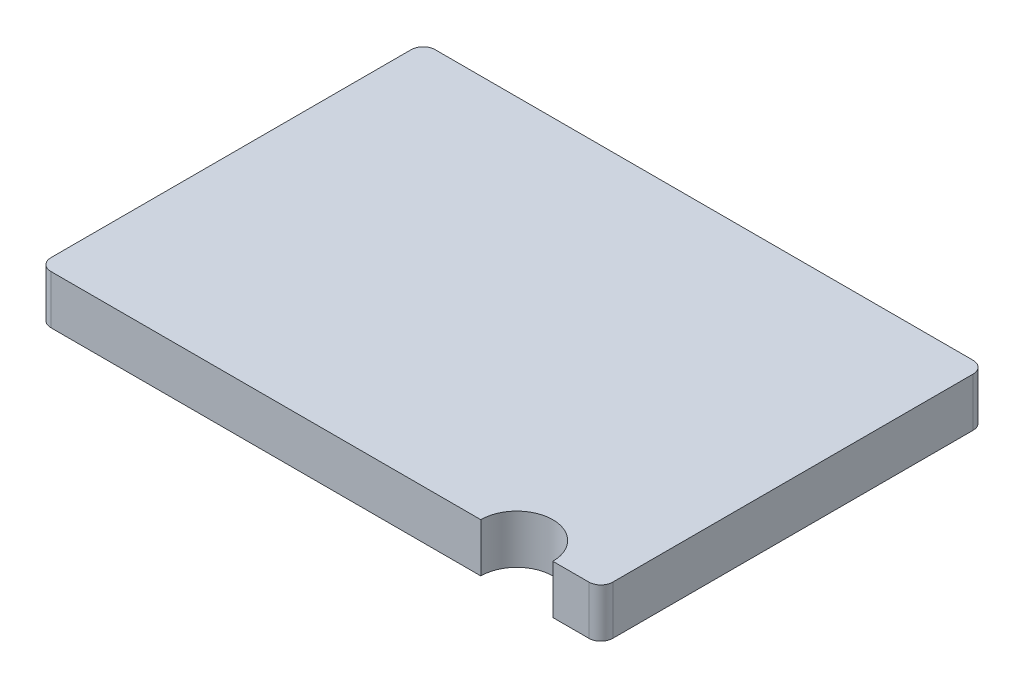
ISO-10303-21;
HEADER;
FILE_DESCRIPTION(('STEP AP214'),'2;1');
FILE_NAME('part.step','',(''),(''),'','','');
FILE_SCHEMA(('AUTOMOTIVE_DESIGN { 1 0 10303 214 1 1 1 1 }'));
ENDSEC;
DATA;
#1=APPLICATION_CONTEXT('core data for automotive mechanical design processes');
#2=APPLICATION_PROTOCOL_DEFINITION('international standard','automotive_design',2000,#1);
#3=PRODUCT_CONTEXT('',#1,'mechanical');
#4=PRODUCT('Part','Part','',(#3));
#5=PRODUCT_RELATED_PRODUCT_CATEGORY('part','',(#4));
#6=PRODUCT_DEFINITION_FORMATION('','',#4);
#7=PRODUCT_DEFINITION_CONTEXT('part definition',#1,'design');
#8=PRODUCT_DEFINITION('design','',#6,#7);
#9=PRODUCT_DEFINITION_SHAPE('','',#8);
#10=(LENGTH_UNIT() NAMED_UNIT(*) SI_UNIT(.MILLI.,.METRE.));
#11=(NAMED_UNIT(*) PLANE_ANGLE_UNIT() SI_UNIT($,.RADIAN.));
#12=(NAMED_UNIT(*) SI_UNIT($,.STERADIAN.) SOLID_ANGLE_UNIT());
#13=UNCERTAINTY_MEASURE_WITH_UNIT(LENGTH_MEASURE(1.E-05),#10,'distance_accuracy_value','');
#14=(GEOMETRIC_REPRESENTATION_CONTEXT(3) GLOBAL_UNCERTAINTY_ASSIGNED_CONTEXT((#13)) GLOBAL_UNIT_ASSIGNED_CONTEXT((#10,
#11,#12)) REPRESENTATION_CONTEXT('',''));
#15=CARTESIAN_POINT('',(0.,0.,0.));
#16=DIRECTION('',(0.,0.,1.));
#17=DIRECTION('',(1.,0.,0.));
#18=AXIS2_PLACEMENT_3D('',#15,#16,#17);
#19=CARTESIAN_POINT('',(-1.17,0.203,0.8));
#20=DIRECTION('',(0.,0.,-1.));
#21=DIRECTION('',(-1.,0.,0.));
#22=AXIS2_PLACEMENT_3D('',#19,#20,#21);
#23=PLANE('',#22);
#24=DIRECTION('',(1.,0.,0.));
#25=VECTOR('',#24,1.);
#26=CARTESIAN_POINT('',(-1.17,0.,0.8));
#27=LINE('',#26,#25);
#28=CARTESIAN_POINT('',(-1.12,0.,0.8));
#29=VERTEX_POINT('',#28);
#30=CARTESIAN_POINT('',(0.670000000000001,0.,0.8));
#31=VERTEX_POINT('',#30);
#32=EDGE_CURVE('E128',#29,#31,#27,.T.);
#33=ORIENTED_EDGE('',*,*,#32,.T.);
#34=DIRECTION('',(0.,1.,0.));
#35=VECTOR('',#34,1.);
#36=CARTESIAN_POINT('',(0.670000000000001,0.,0.8));
#37=LINE('',#36,#35);
#38=CARTESIAN_POINT('',(0.670000000000001,0.203,0.8));
#39=VERTEX_POINT('',#38);
#40=EDGE_CURVE('E50',#31,#39,#37,.T.);
#41=ORIENTED_EDGE('',*,*,#40,.T.);
#42=DIRECTION('',(1.,0.,0.));
#43=VECTOR('',#42,1.);
#44=CARTESIAN_POINT('',(-1.17,0.203,0.8));
#45=LINE('',#44,#43);
#46=CARTESIAN_POINT('',(-1.12,0.203,0.8));
#47=VERTEX_POINT('',#46);
#48=EDGE_CURVE('E140',#47,#39,#45,.T.);
#49=ORIENTED_EDGE('',*,*,#48,.F.);
#50=DIRECTION('',(0.,-1.,0.));
#51=VECTOR('',#50,1.);
#52=CARTESIAN_POINT('',(-1.12,0.203,0.8));
#53=LINE('',#52,#51);
#54=EDGE_CURVE('E43',#47,#29,#53,.T.);
#55=ORIENTED_EDGE('',*,*,#54,.T.);
#56=EDGE_LOOP('',(#33,#41,#49,#55));
#57=FACE_BOUND('',#56,.T.);
#58=ADVANCED_FACE('F35',(#57),#23,.F.);
#59=CARTESIAN_POINT('',(1.17,0.203,-0.8));
#60=DIRECTION('',(-1.,0.,0.));
#61=DIRECTION('',(0.,0.,1.));
#62=AXIS2_PLACEMENT_3D('',#59,#60,#61);
#63=PLANE('',#62);
#64=DIRECTION('',(0.,0.,-1.));
#65=VECTOR('',#64,1.);
#66=CARTESIAN_POINT('',(1.17,0.,-0.8));
#67=LINE('',#66,#65);
#68=CARTESIAN_POINT('',(1.17,0.,0.75));
#69=VERTEX_POINT('',#68);
#70=CARTESIAN_POINT('',(1.17,0.,-0.75));
#71=VERTEX_POINT('',#70);
#72=EDGE_CURVE('E191',#69,#71,#67,.T.);
#73=ORIENTED_EDGE('',*,*,#72,.T.);
#74=DIRECTION('',(0.,-1.,0.));
#75=VECTOR('',#74,1.);
#76=CARTESIAN_POINT('',(1.17,0.203,-0.75));
#77=LINE('',#76,#75);
#78=CARTESIAN_POINT('',(1.17,0.203,-0.75));
#79=VERTEX_POINT('',#78);
#80=EDGE_CURVE('E166',#71,#79,#77,.F.);
#81=ORIENTED_EDGE('',*,*,#80,.T.);
#82=DIRECTION('',(0.,0.,-1.));
#83=VECTOR('',#82,1.);
#84=CARTESIAN_POINT('',(1.17,0.203,-0.8));
#85=LINE('',#84,#83);
#86=CARTESIAN_POINT('',(1.17,0.203,0.75));
#87=VERTEX_POINT('',#86);
#88=EDGE_CURVE('E131',#87,#79,#85,.T.);
#89=ORIENTED_EDGE('',*,*,#88,.F.);
#90=DIRECTION('',(0.,-1.,0.));
#91=VECTOR('',#90,1.);
#92=CARTESIAN_POINT('',(1.17,0.203,0.75));
#93=LINE('',#92,#91);
#94=EDGE_CURVE('E163',#87,#69,#93,.T.);
#95=ORIENTED_EDGE('',*,*,#94,.T.);
#96=EDGE_LOOP('',(#73,#81,#89,#95));
#97=FACE_BOUND('',#96,.T.);
#98=ADVANCED_FACE('F215',(#97),#63,.F.);
#99=CARTESIAN_POINT('',(-1.17,0.203,-0.8));
#100=DIRECTION('',(0.,0.,1.));
#101=DIRECTION('',(1.,0.,0.));
#102=AXIS2_PLACEMENT_3D('',#99,#100,#101);
#103=PLANE('',#102);
#104=DIRECTION('',(-1.,0.,0.));
#105=VECTOR('',#104,1.);
#106=CARTESIAN_POINT('',(-1.17,0.,-0.8));
#107=LINE('',#106,#105);
#108=CARTESIAN_POINT('',(1.12,0.,-0.8));
#109=VERTEX_POINT('',#108);
#110=CARTESIAN_POINT('',(-1.12,0.,-0.8));
#111=VERTEX_POINT('',#110);
#112=EDGE_CURVE('E133',#109,#111,#107,.T.);
#113=ORIENTED_EDGE('',*,*,#112,.T.);
#114=DIRECTION('',(0.,-1.,0.));
#115=VECTOR('',#114,1.);
#116=CARTESIAN_POINT('',(-1.12,0.203,-0.8));
#117=LINE('',#116,#115);
#118=CARTESIAN_POINT('',(-1.12,0.203,-0.8));
#119=VERTEX_POINT('',#118);
#120=EDGE_CURVE('E153',#111,#119,#117,.F.);
#121=ORIENTED_EDGE('',*,*,#120,.T.);
#122=DIRECTION('',(-1.,0.,0.));
#123=VECTOR('',#122,1.);
#124=CARTESIAN_POINT('',(-1.17,0.203,-0.8));
#125=LINE('',#124,#123);
#126=CARTESIAN_POINT('',(1.12,0.203,-0.8));
#127=VERTEX_POINT('',#126);
#128=EDGE_CURVE('E185',#127,#119,#125,.T.);
#129=ORIENTED_EDGE('',*,*,#128,.F.);
#130=DIRECTION('',(0.,-1.,0.));
#131=VECTOR('',#130,1.);
#132=CARTESIAN_POINT('',(1.12,0.203,-0.8));
#133=LINE('',#132,#131);
#134=EDGE_CURVE('E150',#127,#109,#133,.T.);
#135=ORIENTED_EDGE('',*,*,#134,.T.);
#136=EDGE_LOOP('',(#113,#121,#129,#135));
#137=FACE_BOUND('',#136,.T.);
#138=ADVANCED_FACE('F197',(#137),#103,.F.);
#139=CARTESIAN_POINT('',(-1.17,0.203,-0.8));
#140=DIRECTION('',(1.,0.,0.));
#141=DIRECTION('',(0.,0.,-1.));
#142=AXIS2_PLACEMENT_3D('',#139,#140,#141);
#143=PLANE('',#142);
#144=DIRECTION('',(0.,0.,1.));
#145=VECTOR('',#144,1.);
#146=CARTESIAN_POINT('',(-1.17,0.203,-0.8));
#147=LINE('',#146,#145);
#148=CARTESIAN_POINT('',(-1.17,0.203,-0.75));
#149=VERTEX_POINT('',#148);
#150=CARTESIAN_POINT('',(-1.17,0.203,0.75));
#151=VERTEX_POINT('',#150);
#152=EDGE_CURVE('E182',#149,#151,#147,.T.);
#153=ORIENTED_EDGE('',*,*,#152,.F.);
#154=DIRECTION('',(0.,-1.,0.));
#155=VECTOR('',#154,1.);
#156=CARTESIAN_POINT('',(-1.17,0.203,-0.75));
#157=LINE('',#156,#155);
#158=CARTESIAN_POINT('',(-1.17,0.,-0.75));
#159=VERTEX_POINT('',#158);
#160=EDGE_CURVE('E139',#149,#159,#157,.T.);
#161=ORIENTED_EDGE('',*,*,#160,.T.);
#162=DIRECTION('',(0.,0.,1.));
#163=VECTOR('',#162,1.);
#164=CARTESIAN_POINT('',(-1.17,0.,-0.8));
#165=LINE('',#164,#163);
#166=CARTESIAN_POINT('',(-1.17,0.,0.75));
#167=VERTEX_POINT('',#166);
#168=EDGE_CURVE('E129',#159,#167,#165,.T.);
#169=ORIENTED_EDGE('',*,*,#168,.T.);
#170=DIRECTION('',(0.,-1.,0.));
#171=VECTOR('',#170,1.);
#172=CARTESIAN_POINT('',(-1.17,0.203,0.75));
#173=LINE('',#172,#171);
#174=EDGE_CURVE('E137',#167,#151,#173,.F.);
#175=ORIENTED_EDGE('',*,*,#174,.T.);
#176=EDGE_LOOP('',(#153,#161,#169,#175));
#177=FACE_BOUND('',#176,.T.);
#178=ADVANCED_FACE('F178',(#177),#143,.F.);
#179=CARTESIAN_POINT('',(0.970000000000001,0.203,0.8));
#180=VERTEX_POINT('',#179);
#181=CARTESIAN_POINT('',(1.12,0.203,0.8));
#182=VERTEX_POINT('',#181);
#183=EDGE_CURVE('E58',#180,#182,#45,.T.);
#184=ORIENTED_EDGE('',*,*,#183,.F.);
#185=DIRECTION('',(0.,1.,0.));
#186=VECTOR('',#185,1.);
#187=CARTESIAN_POINT('',(0.970000000000001,0.,0.8));
#188=LINE('',#187,#186);
#189=CARTESIAN_POINT('',(0.970000000000001,0.,0.8));
#190=VERTEX_POINT('',#189);
#191=EDGE_CURVE('E112',#180,#190,#188,.F.);
#192=ORIENTED_EDGE('',*,*,#191,.T.);
#193=CARTESIAN_POINT('',(1.12,0.,0.8));
#194=VERTEX_POINT('',#193);
#195=EDGE_CURVE('E121',#190,#194,#27,.T.);
#196=ORIENTED_EDGE('',*,*,#195,.T.);
#197=DIRECTION('',(0.,-1.,0.));
#198=VECTOR('',#197,1.);
#199=CARTESIAN_POINT('',(1.12,0.203,0.8));
#200=LINE('',#199,#198);
#201=EDGE_CURVE('E11',#194,#182,#200,.F.);
#202=ORIENTED_EDGE('',*,*,#201,.T.);
#203=EDGE_LOOP('',(#184,#192,#196,#202));
#204=FACE_BOUND('',#203,.T.);
#205=ADVANCED_FACE('F120',(#204),#23,.F.);
#206=CARTESIAN_POINT('',(0.,0.203,0.));
#207=DIRECTION('',(0.,1.,0.));
#208=DIRECTION('',(0.,0.,1.));
#209=AXIS2_PLACEMENT_3D('',#206,#207,#208);
#210=PLANE('',#209);
#211=CARTESIAN_POINT('',(0.820000000000001,0.203,0.8));
#212=DIRECTION('',(0.,1.,0.));
#213=DIRECTION('',(0.,0.,1.));
#214=AXIS2_PLACEMENT_3D('',#211,#212,#213);
#215=CIRCLE('',#214,0.15);
#216=EDGE_CURVE('E117',#180,#39,#215,.T.);
#217=ORIENTED_EDGE('',*,*,#216,.F.);
#218=ORIENTED_EDGE('',*,*,#183,.T.);
#219=CARTESIAN_POINT('',(1.12,0.203,0.75));
#220=DIRECTION('',(0.,1.,0.));
#221=DIRECTION('',(0.,0.,1.));
#222=AXIS2_PLACEMENT_3D('',#219,#220,#221);
#223=CIRCLE('',#222,0.05);
#224=EDGE_CURVE('E157',#182,#87,#223,.T.);
#225=ORIENTED_EDGE('',*,*,#224,.T.);
#226=ORIENTED_EDGE('',*,*,#88,.T.);
#227=CARTESIAN_POINT('',(1.12,0.203,-0.75));
#228=DIRECTION('',(0.,1.,0.));
#229=DIRECTION('',(0.,0.,1.));
#230=AXIS2_PLACEMENT_3D('',#227,#228,#229);
#231=CIRCLE('',#230,0.05);
#232=EDGE_CURVE('E159',#79,#127,#231,.T.);
#233=ORIENTED_EDGE('',*,*,#232,.T.);
#234=ORIENTED_EDGE('',*,*,#128,.T.);
#235=CARTESIAN_POINT('',(-1.12,0.203,-0.75));
#236=DIRECTION('',(0.,1.,0.));
#237=DIRECTION('',(0.,0.,1.));
#238=AXIS2_PLACEMENT_3D('',#235,#236,#237);
#239=CIRCLE('',#238,0.05);
#240=EDGE_CURVE('E161',#119,#149,#239,.T.);
#241=ORIENTED_EDGE('',*,*,#240,.T.);
#242=ORIENTED_EDGE('',*,*,#152,.T.);
#243=CARTESIAN_POINT('',(-1.12,0.203,0.75));
#244=DIRECTION('',(0.,1.,0.));
#245=DIRECTION('',(0.,0.,1.));
#246=AXIS2_PLACEMENT_3D('',#243,#244,#245);
#247=CIRCLE('',#246,0.05);
#248=EDGE_CURVE('E155',#151,#47,#247,.T.);
#249=ORIENTED_EDGE('',*,*,#248,.T.);
#250=ORIENTED_EDGE('',*,*,#48,.T.);
#251=EDGE_LOOP('',(#217,#218,#225,#226,#233,#234,#241,#242,#249,#250));
#252=FACE_BOUND('',#251,.T.);
#253=ADVANCED_FACE('F181',(#252),#210,.T.);
#254=CARTESIAN_POINT('',(0.,0.,0.));
#255=DIRECTION('',(0.,1.,0.));
#256=DIRECTION('',(0.,0.,1.));
#257=AXIS2_PLACEMENT_3D('',#254,#255,#256);
#258=PLANE('',#257);
#259=ORIENTED_EDGE('',*,*,#195,.F.);
#260=CARTESIAN_POINT('',(0.820000000000001,0.,0.8));
#261=DIRECTION('',(0.,1.,0.));
#262=DIRECTION('',(0.,0.,1.));
#263=AXIS2_PLACEMENT_3D('',#260,#261,#262);
#264=CIRCLE('',#263,0.15);
#265=EDGE_CURVE('E109',#190,#31,#264,.T.);
#266=ORIENTED_EDGE('',*,*,#265,.T.);
#267=ORIENTED_EDGE('',*,*,#32,.F.);
#268=CARTESIAN_POINT('',(-1.12,0.,0.75));
#269=DIRECTION('',(0.,1.,0.));
#270=DIRECTION('',(0.,0.,1.));
#271=AXIS2_PLACEMENT_3D('',#268,#269,#270);
#272=CIRCLE('',#271,0.05);
#273=EDGE_CURVE('E143',#29,#167,#272,.F.);
#274=ORIENTED_EDGE('',*,*,#273,.T.);
#275=ORIENTED_EDGE('',*,*,#168,.F.);
#276=CARTESIAN_POINT('',(-1.12,0.,-0.75));
#277=DIRECTION('',(0.,1.,0.));
#278=DIRECTION('',(0.,0.,1.));
#279=AXIS2_PLACEMENT_3D('',#276,#277,#278);
#280=CIRCLE('',#279,0.05);
#281=EDGE_CURVE('E148',#159,#111,#280,.F.);
#282=ORIENTED_EDGE('',*,*,#281,.T.);
#283=ORIENTED_EDGE('',*,*,#112,.F.);
#284=CARTESIAN_POINT('',(1.12,0.,-0.75));
#285=DIRECTION('',(0.,1.,0.));
#286=DIRECTION('',(0.,0.,1.));
#287=AXIS2_PLACEMENT_3D('',#284,#285,#286);
#288=CIRCLE('',#287,0.05);
#289=EDGE_CURVE('E146',#109,#71,#288,.F.);
#290=ORIENTED_EDGE('',*,*,#289,.T.);
#291=ORIENTED_EDGE('',*,*,#72,.F.);
#292=CARTESIAN_POINT('',(1.12,0.,0.75));
#293=DIRECTION('',(0.,1.,0.));
#294=DIRECTION('',(0.,0.,1.));
#295=AXIS2_PLACEMENT_3D('',#292,#293,#294);
#296=CIRCLE('',#295,0.05);
#297=EDGE_CURVE('E126',#69,#194,#296,.F.);
#298=ORIENTED_EDGE('',*,*,#297,.T.);
#299=EDGE_LOOP('',(#259,#266,#267,#274,#275,#282,#283,#290,#291,#298));
#300=FACE_BOUND('',#299,.T.);
#301=ADVANCED_FACE('F124',(#300),#258,.F.);
#302=CARTESIAN_POINT('',(-1.12,0.203,-0.75));
#303=DIRECTION('',(0.,-1.,0.));
#304=DIRECTION('',(0.,0.,-1.));
#305=AXIS2_PLACEMENT_3D('',#302,#303,#304);
#306=CYLINDRICAL_SURFACE('',#305,0.05);
#307=ORIENTED_EDGE('',*,*,#240,.F.);
#308=ORIENTED_EDGE('',*,*,#120,.F.);
#309=ORIENTED_EDGE('',*,*,#281,.F.);
#310=ORIENTED_EDGE('',*,*,#160,.F.);
#311=EDGE_LOOP('',(#307,#308,#309,#310));
#312=FACE_BOUND('',#311,.T.);
#313=ADVANCED_FACE('F201',(#312),#306,.T.);
#314=CARTESIAN_POINT('',(1.12,0.203,-0.75));
#315=DIRECTION('',(0.,-1.,0.));
#316=DIRECTION('',(0.,0.,-1.));
#317=AXIS2_PLACEMENT_3D('',#314,#315,#316);
#318=CYLINDRICAL_SURFACE('',#317,0.05);
#319=ORIENTED_EDGE('',*,*,#232,.F.);
#320=ORIENTED_EDGE('',*,*,#80,.F.);
#321=ORIENTED_EDGE('',*,*,#289,.F.);
#322=ORIENTED_EDGE('',*,*,#134,.F.);
#323=EDGE_LOOP('',(#319,#320,#321,#322));
#324=FACE_BOUND('',#323,.T.);
#325=ADVANCED_FACE('F203',(#324),#318,.T.);
#326=CARTESIAN_POINT('',(1.12,0.203,0.75));
#327=DIRECTION('',(0.,-1.,0.));
#328=DIRECTION('',(0.,0.,-1.));
#329=AXIS2_PLACEMENT_3D('',#326,#327,#328);
#330=CYLINDRICAL_SURFACE('',#329,0.05);
#331=ORIENTED_EDGE('',*,*,#224,.F.);
#332=ORIENTED_EDGE('',*,*,#201,.F.);
#333=ORIENTED_EDGE('',*,*,#297,.F.);
#334=ORIENTED_EDGE('',*,*,#94,.F.);
#335=EDGE_LOOP('',(#331,#332,#333,#334));
#336=FACE_BOUND('',#335,.T.);
#337=ADVANCED_FACE('F209',(#336),#330,.T.);
#338=CARTESIAN_POINT('',(-1.12,0.203,0.75));
#339=DIRECTION('',(0.,-1.,0.));
#340=DIRECTION('',(0.,0.,-1.));
#341=AXIS2_PLACEMENT_3D('',#338,#339,#340);
#342=CYLINDRICAL_SURFACE('',#341,0.05);
#343=ORIENTED_EDGE('',*,*,#248,.F.);
#344=ORIENTED_EDGE('',*,*,#174,.F.);
#345=ORIENTED_EDGE('',*,*,#273,.F.);
#346=ORIENTED_EDGE('',*,*,#54,.F.);
#347=EDGE_LOOP('',(#343,#344,#345,#346));
#348=FACE_BOUND('',#347,.T.);
#349=ADVANCED_FACE('F37',(#348),#342,.T.);
#350=CARTESIAN_POINT('',(0.820000000000001,0.,0.8));
#351=DIRECTION('',(0.,1.,0.));
#352=DIRECTION('',(0.,0.,1.));
#353=AXIS2_PLACEMENT_3D('',#350,#351,#352);
#354=CYLINDRICAL_SURFACE('',#353,0.15);
#355=ORIENTED_EDGE('',*,*,#265,.F.);
#356=ORIENTED_EDGE('',*,*,#191,.F.);
#357=ORIENTED_EDGE('',*,*,#216,.T.);
#358=ORIENTED_EDGE('',*,*,#40,.F.);
#359=EDGE_LOOP('',(#355,#356,#357,#358));
#360=FACE_BOUND('',#359,.T.);
#361=ADVANCED_FACE('F111',(#360),#354,.F.);
#362=CLOSED_SHELL('',(#58,#98,#138,#178,#205,#253,#301,#313,#325,#337,#349,#361));
#363=MANIFOLD_SOLID_BREP('B2',#362);
#364=ADVANCED_BREP_SHAPE_REPRESENTATION('',(#18,#363),#14);
#365=SHAPE_DEFINITION_REPRESENTATION(#9,#364);
ENDSEC;
END-ISO-10303-21;
